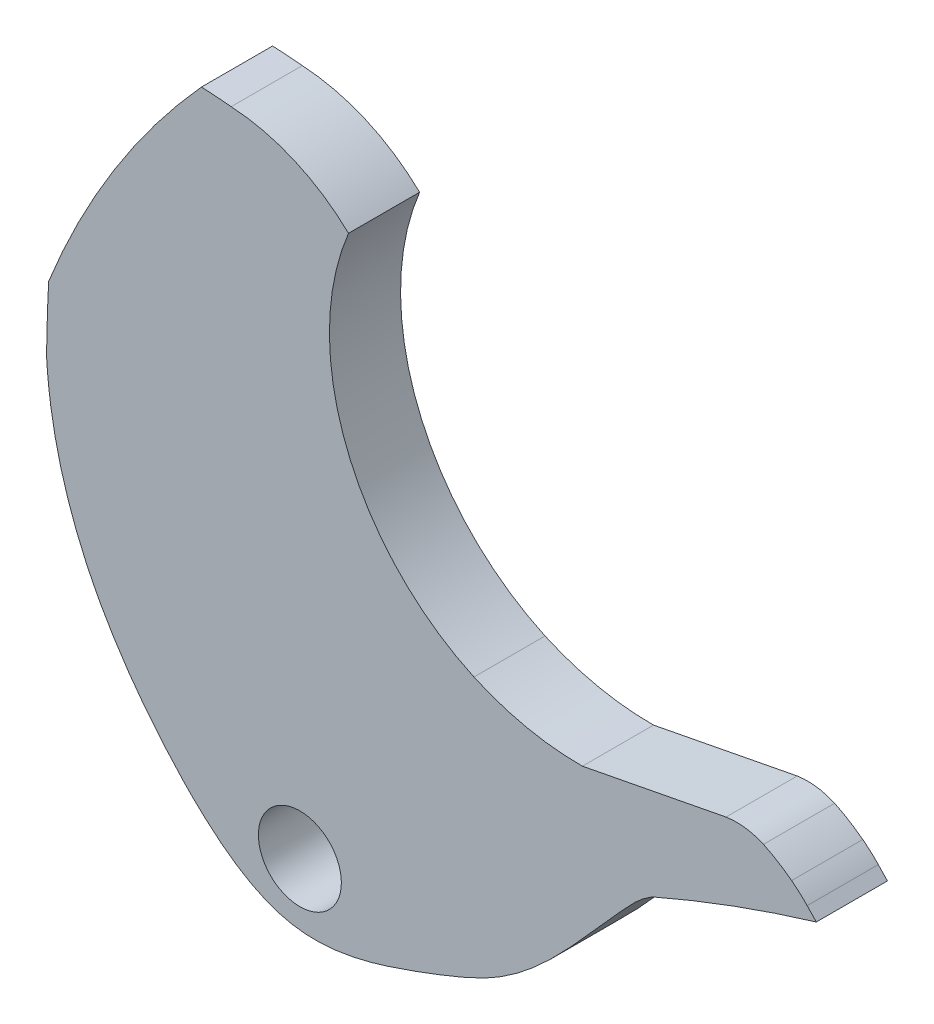
ISO-10303-21;
HEADER;
FILE_DESCRIPTION(('STEP AP214'),'2;1');
FILE_NAME('part.step','',(''),(''),'','','');
FILE_SCHEMA(('AUTOMOTIVE_DESIGN { 1 0 10303 214 1 1 1 1 }'));
ENDSEC;
DATA;
#1=APPLICATION_CONTEXT('core data for automotive mechanical design processes');
#2=APPLICATION_PROTOCOL_DEFINITION('international standard','automotive_design',2000,#1);
#3=PRODUCT_CONTEXT('',#1,'mechanical');
#4=PRODUCT('Part','Part','',(#3));
#5=PRODUCT_RELATED_PRODUCT_CATEGORY('part','',(#4));
#6=PRODUCT_DEFINITION_FORMATION('','',#4);
#7=PRODUCT_DEFINITION_CONTEXT('part definition',#1,'design');
#8=PRODUCT_DEFINITION('design','',#6,#7);
#9=PRODUCT_DEFINITION_SHAPE('','',#8);
#10=(LENGTH_UNIT() NAMED_UNIT(*) SI_UNIT(.MILLI.,.METRE.));
#11=(NAMED_UNIT(*) PLANE_ANGLE_UNIT() SI_UNIT($,.RADIAN.));
#12=(NAMED_UNIT(*) SI_UNIT($,.STERADIAN.) SOLID_ANGLE_UNIT());
#13=UNCERTAINTY_MEASURE_WITH_UNIT(LENGTH_MEASURE(1.E-05),#10,'distance_accuracy_value','');
#14=(GEOMETRIC_REPRESENTATION_CONTEXT(3) GLOBAL_UNCERTAINTY_ASSIGNED_CONTEXT((#13)) GLOBAL_UNIT_ASSIGNED_CONTEXT((#10,
#11,#12)) REPRESENTATION_CONTEXT('',''));
#15=CARTESIAN_POINT('',(0.,0.,0.));
#16=DIRECTION('',(0.,0.,1.));
#17=DIRECTION('',(1.,0.,0.));
#18=AXIS2_PLACEMENT_3D('',#15,#16,#17);
#19=CARTESIAN_POINT('',(8.25117117101575,-8.73657227185161,3.));
#20=DIRECTION('',(0.,0.,-1.));
#21=DIRECTION('',(-1.,0.,0.));
#22=AXIS2_PLACEMENT_3D('',#19,#20,#21);
#23=PLANE('',#22);
#24=CARTESIAN_POINT('',(9.62028650351375,-8.12784722487816,3.));
#25=CARTESIAN_POINT('',(9.17980211864895,-8.35044285989711,3.));
#26=CARTESIAN_POINT('',(8.72236085574302,-8.54750622541841,3.));
#27=CARTESIAN_POINT('',(8.01557632865212,-8.83110529506821,3.));
#28=CARTESIAN_POINT('',(7.77675812644258,-8.92404130425969,3.));
#29=CARTESIAN_POINT('',(7.29779458170795,-9.10631165689272,3.));
#30=CARTESIAN_POINT('',(7.05652031328897,-9.19587523587977,3.));
#31=CARTESIAN_POINT('',(6.81145608223271,-9.28468398787428,3.));
#32=B_SPLINE_CURVE_WITH_KNOTS('',3,(#24,#25,#26,#27,#28,#29,#30,#31),.UNSPECIFIED.,.F.,.F.,(4,2,
2,4),(0.,0.499999999999999,0.75,1.),.UNSPECIFIED.);
#33=CARTESIAN_POINT('',(6.81145608223271,-9.28468398787428,3.));
#34=VERTEX_POINT('',#33);
#35=CARTESIAN_POINT('',(9.62028650351375,-8.12784722487816,3.));
#36=VERTEX_POINT('',#35);
#37=EDGE_CURVE('E471',#34,#36,#32,.F.);
#38=ORIENTED_EDGE('',*,*,#37,.T.);
#39=CARTESIAN_POINT('',(16.8281752455163,-1.56135640571104,3.));
#40=CARTESIAN_POINT('',(16.6529192677787,-1.66446730117213,3.));
#41=CARTESIAN_POINT('',(16.4793040516283,-1.78580578128182,3.));
#42=CARTESIAN_POINT('',(16.169367003085,-2.04745330031033,3.));
#43=CARTESIAN_POINT('',(16.0298014146576,-2.18606812669837,3.));
#44=CARTESIAN_POINT('',(15.7437801668966,-2.48344053739451,3.));
#45=CARTESIAN_POINT('',(15.6021223854301,-2.63772679363682,3.));
#46=CARTESIAN_POINT('',(15.3236341426486,-2.94225173327598,3.));
#47=CARTESIAN_POINT('',(15.1849005778334,-3.09577571043314,3.));
#48=CARTESIAN_POINT('',(14.492337709762,-3.86973509951323,3.));
#49=CARTESIAN_POINT('',(13.946319139545,-4.50148997946698,3.));
#50=CARTESIAN_POINT('',(12.82093123337,-5.71203588118625,3.));
#51=CARTESIAN_POINT('',(12.2426101895869,-6.29113321402237,3.));
#52=CARTESIAN_POINT('',(11.3126737743175,-7.06418323190302,3.));
#53=CARTESIAN_POINT('',(10.9901237091513,-7.30737387180373,3.));
#54=CARTESIAN_POINT('',(10.4909670183963,-7.63855840106054,3.));
#55=CARTESIAN_POINT('',(10.3228661674392,-7.74264862921469,3.));
#56=CARTESIAN_POINT('',(9.97733967148719,-7.94180455004197,3.));
#57=CARTESIAN_POINT('',(9.80038257206845,-8.03683696407936,3.));
#58=CARTESIAN_POINT('',(9.62028650351375,-8.12784722487816,3.));
#59=B_SPLINE_CURVE_WITH_KNOTS('',3,(#39,#40,#41,#42,#43,#44,#45,#46,#47,#48,#49,#50,#51,#52,#53,
#54,#55,#56,#57,#58),.UNSPECIFIED.,.F.,.F.,(4,2,2,2,2,2,2,2,2,4),(0.,0.0624999999999999,0.125,
0.1875,0.25,0.5,0.75,0.874999999999999,0.9375,1.),.UNSPECIFIED.);
#60=CARTESIAN_POINT('',(16.8281752455163,-1.56135640571104,3.));
#61=VERTEX_POINT('',#60);
#62=EDGE_CURVE('E138',#36,#61,#59,.F.);
#63=ORIENTED_EDGE('',*,*,#62,.T.);
#64=CARTESIAN_POINT('',(41.4114635115163,-57.8448043143015,3.));
#65=DIRECTION('',(0.,0.,-1.));
#66=DIRECTION('',(1.,0.,0.));
#67=AXIS2_PLACEMENT_3D('',#64,#65,#66);
#68=CIRCLE('',#67,61.4179499043095);
#69=CARTESIAN_POINT('',(23.736412446226,0.974895959396316,3.));
#70=VERTEX_POINT('',#69);
#71=EDGE_CURVE('E392',#61,#70,#68,.T.);
#72=ORIENTED_EDGE('',*,*,#71,.T.);
#73=DIRECTION('',(-0.688314294819464,0.725412594009219,0.));
#74=VECTOR('',#73,1.);
#75=CARTESIAN_POINT('',(23.3513313053024,1.3807319436899,3.));
#76=LINE('',#75,#74);
#77=CARTESIAN_POINT('',(23.3513313053024,1.3807319436899,3.));
#78=VERTEX_POINT('',#77);
#79=EDGE_CURVE('E386',#70,#78,#76,.T.);
#80=ORIENTED_EDGE('',*,*,#79,.T.);
#81=CARTESIAN_POINT('',(19.3615620382517,-2.40499667781716,3.));
#82=DIRECTION('',(0.,0.,1.));
#83=DIRECTION('',(1.,0.,0.));
#84=AXIS2_PLACEMENT_3D('',#81,#82,#83);
#85=CIRCLE('',#84,5.49999999999999);
#86=CARTESIAN_POINT('',(22.6965246464227,1.96856301676817,3.));
#87=VERTEX_POINT('',#86);
#88=EDGE_CURVE('E391',#78,#87,#85,.T.);
#89=ORIENTED_EDGE('',*,*,#88,.T.);
#90=CARTESIAN_POINT('',(18.4479944033127,-3.603073854652,3.));
#91=DIRECTION('',(0.,0.,1.));
#92=DIRECTION('',(1.,0.,0.));
#93=AXIS2_PLACEMENT_3D('',#90,#91,#92);
#94=CIRCLE('',#93,7.00665017348438);
#95=CARTESIAN_POINT('',(21.5092543607841,2.69945215690648,3.));
#96=VERTEX_POINT('',#95);
#97=EDGE_CURVE('E394',#87,#96,#94,.T.);
#98=ORIENTED_EDGE('',*,*,#97,.T.);
#99=CARTESIAN_POINT('',(20.3707949009142,0.134545093826682,3.));
#100=DIRECTION('',(0.,0.,1.));
#101=DIRECTION('',(1.,0.,0.));
#102=AXIS2_PLACEMENT_3D('',#99,#100,#101);
#103=CIRCLE('',#102,2.80621420850295);
#104=CARTESIAN_POINT('',(19.9304110032006,2.90598879822308,3.));
#105=VERTEX_POINT('',#104);
#106=EDGE_CURVE('E396',#96,#105,#103,.T.);
#107=ORIENTED_EDGE('',*,*,#106,.T.);
#108=DIRECTION('',(-0.981845475111508,-0.189682532150585,0.));
#109=VECTOR('',#108,1.);
#110=CARTESIAN_POINT('',(19.9304110032006,2.90598879822308,3.));
#111=LINE('',#110,#109);
#112=CARTESIAN_POINT('',(13.8714523803976,1.73545978637591,3.));
#113=VERTEX_POINT('',#112);
#114=EDGE_CURVE('E398',#105,#113,#111,.T.);
#115=ORIENTED_EDGE('',*,*,#114,.T.);
#116=CARTESIAN_POINT('',(13.8009070771151,12.7020945939278,3.));
#117=DIRECTION('',(0.,0.,-1.));
#118=DIRECTION('',(1.,0.,0.));
#119=AXIS2_PLACEMENT_3D('',#116,#117,#118);
#120=CIRCLE('',#119,10.9668617043357);
#121=CARTESIAN_POINT('',(9.29603098715299,2.70318730082263,3.));
#122=VERTEX_POINT('',#121);
#123=EDGE_CURVE('E400',#113,#122,#120,.T.);
#124=ORIENTED_EDGE('',*,*,#123,.T.);
#125=CARTESIAN_POINT('',(13.7019216888151,12.2340910945353,3.));
#126=DIRECTION('',(0.,0.,-1.));
#127=DIRECTION('',(1.,0.,0.));
#128=AXIS2_PLACEMENT_3D('',#125,#126,#127);
#129=CIRCLE('',#128,10.4999999999999);
#130=CARTESIAN_POINT('',(4.00684121775,16.2658915186102,3.));
#131=VERTEX_POINT('',#130);
#132=EDGE_CURVE('E402',#122,#131,#129,.T.);
#133=ORIENTED_EDGE('',*,*,#132,.T.);
#134=CARTESIAN_POINT('',(-1.3940604911973,10.6052564925856,3.));
#135=DIRECTION('',(0.,0.,1.));
#136=DIRECTION('',(1.,0.,0.));
#137=AXIS2_PLACEMENT_3D('',#134,#135,#136);
#138=CIRCLE('',#137,7.82384356742683);
#139=CARTESIAN_POINT('',(-0.941946898938551,18.4160260748522,3.));
#140=VERTEX_POINT('',#139);
#141=EDGE_CURVE('E404',#131,#140,#138,.T.);
#142=ORIENTED_EDGE('',*,*,#141,.T.);
#143=CARTESIAN_POINT('',(-2.99299060987345,-1.69203897930691,3.));
#144=DIRECTION('',(0.,0.,1.));
#145=DIRECTION('',(1.,0.,0.));
#146=AXIS2_PLACEMENT_3D('',#143,#144,#145);
#147=CIRCLE('',#146,20.2123986831465);
#148=CARTESIAN_POINT('',(-2.1971601713027,18.5046863602006,3.));
#149=VERTEX_POINT('',#148);
#150=EDGE_CURVE('E406',#140,#149,#147,.T.);
#151=ORIENTED_EDGE('',*,*,#150,.T.);
#152=CARTESIAN_POINT('',(23.1641359216795,-4.50275843434775,3.));
#153=DIRECTION('',(0.,0.,1.));
#154=DIRECTION('',(1.,0.,0.));
#155=AXIS2_PLACEMENT_3D('',#152,#153,#154);
#156=CIRCLE('',#155,34.2423400995041);
#157=CARTESIAN_POINT('',(-8.63903891674994,8.18959854481075,3.));
#158=VERTEX_POINT('',#157);
#159=EDGE_CURVE('E408',#149,#158,#156,.T.);
#160=ORIENTED_EDGE('',*,*,#159,.T.);
#161=CARTESIAN_POINT('',(60.6415600077409,4.59193536232363,3.));
#162=DIRECTION('',(0.,0.,1.));
#163=DIRECTION('',(-1.,0.,0.));
#164=AXIS2_PLACEMENT_3D('',#161,#162,#163);
#165=CIRCLE('',#164,69.3739473268662);
#166=CARTESIAN_POINT('',(-8.72752538677928,5.41325091591366,3.));
#167=VERTEX_POINT('',#166);
#168=EDGE_CURVE('E410',#158,#167,#165,.T.);
#169=ORIENTED_EDGE('',*,*,#168,.T.);
#170=CARTESIAN_POINT('',(10.201841043741,6.46747029915103,3.));
#171=DIRECTION('',(0.,0.,1.));
#172=DIRECTION('',(1.,0.,0.));
#173=AXIS2_PLACEMENT_3D('',#170,#171,#172);
#174=CIRCLE('',#173,18.9586996381319);
#175=CARTESIAN_POINT('',(-8.6833723894637,4.79983558159267,3.));
#176=VERTEX_POINT('',#175);
#177=EDGE_CURVE('E412',#167,#176,#174,.T.);
#178=ORIENTED_EDGE('',*,*,#177,.T.);
#179=CARTESIAN_POINT('',(-7.06400769560621,-1.28129997996168,3.));
#180=CARTESIAN_POINT('',(-7.50205297870856,-0.33160611677286,3.));
#181=CARTESIAN_POINT('',(-7.85937118671749,0.648508115106866,3.));
#182=CARTESIAN_POINT('',(-8.40229429907405,2.67447956130265,3.));
#183=CARTESIAN_POINT('',(-8.58807459137486,3.72116380460375,3.));
#184=CARTESIAN_POINT('',(-8.68337238946358,4.79983558159268,3.));
#185=B_SPLINE_CURVE_WITH_KNOTS('',3,(#179,#180,#181,#182,#183,#184),.UNSPECIFIED.,.F.,.F.,(4,2,
4),(0.,0.5,1.),.UNSPECIFIED.);
#186=CARTESIAN_POINT('',(-7.06400769560621,-1.28129997996168,3.));
#187=VERTEX_POINT('',#186);
#188=EDGE_CURVE('E771',#176,#187,#185,.F.);
#189=ORIENTED_EDGE('',*,*,#188,.T.);
#190=CARTESIAN_POINT('',(-2.97381791978536,-7.20382634162153,3.));
#191=CARTESIAN_POINT('',(-3.40882724033922,-6.74810305034977,3.));
#192=CARTESIAN_POINT('',(-3.81797623210393,-6.28180118328278,3.));
#193=CARTESIAN_POINT('',(-4.59187789010131,-5.32914333541592,3.));
#194=CARTESIAN_POINT('',(-4.95762994762071,-4.84262589012287,3.));
#195=CARTESIAN_POINT('',(-5.98506042983869,-3.36121667474243,3.));
#196=CARTESIAN_POINT('',(-6.57517087116233,-2.34111126017262,3.));
#197=CARTESIAN_POINT('',(-7.06400769560621,-1.28129997996168,3.));
#198=B_SPLINE_CURVE_WITH_KNOTS('',3,(#190,#191,#192,#193,#194,#195,#196,#197),.UNSPECIFIED.,.F.,
.F.,(4,2,2,4),(0.,0.25,0.5,1.),.UNSPECIFIED.);
#199=CARTESIAN_POINT('',(-2.97381791978536,-7.20382634162153,3.));
#200=VERTEX_POINT('',#199);
#201=EDGE_CURVE('E196',#187,#200,#198,.F.);
#202=ORIENTED_EDGE('',*,*,#201,.T.);
#203=CARTESIAN_POINT('',(1.60276659843023,-10.1599057250444,3.));
#204=CARTESIAN_POINT('',(1.39100926344457,-10.1210471290185,3.));
#205=CARTESIAN_POINT('',(1.1817732939461,-10.0677256483114,3.));
#206=CARTESIAN_POINT('',(0.764136140560738,-9.93388728338505,3.));
#207=CARTESIAN_POINT('',(0.556953087107,-9.85365075535664,3.));
#208=CARTESIAN_POINT('',(-0.0535130630887347,-9.57950774710137,3.));
#209=CARTESIAN_POINT('',(-0.445412996672957,-9.35234524044181,3.));
#210=CARTESIAN_POINT('',(-1.59027920639914,-8.56570688958112,3.));
#211=CARTESIAN_POINT('',(-2.30644650900845,-7.90297617920669,3.));
#212=CARTESIAN_POINT('',(-2.97381791978536,-7.20382634162153,3.));
#213=B_SPLINE_CURVE_WITH_KNOTS('',3,(#203,#204,#205,#206,#207,#208,#209,#210,#211,#212),
.UNSPECIFIED.,.F.,.F.,(4,2,2,2,4),(0.,0.125,0.25,0.5,1.),.UNSPECIFIED.);
#214=CARTESIAN_POINT('',(1.60276659843023,-10.1599057250444,3.));
#215=VERTEX_POINT('',#214);
#216=EDGE_CURVE('E188',#200,#215,#213,.F.);
#217=ORIENTED_EDGE('',*,*,#216,.T.);
#218=CARTESIAN_POINT('',(4.22745433705887,-10.0642248372999,3.));
#219=CARTESIAN_POINT('',(3.77994434838323,-10.157384511052,3.));
#220=CARTESIAN_POINT('',(3.33727275371652,-10.2203682924585,3.));
#221=CARTESIAN_POINT('',(2.45901895610473,-10.2600164317434,3.));
#222=CARTESIAN_POINT('',(2.01987178261533,-10.2364467424012,3.));
#223=CARTESIAN_POINT('',(1.60276659843023,-10.1599057250444,3.));
#224=B_SPLINE_CURVE_WITH_KNOTS('',3,(#218,#219,#220,#221,#222,#223),.UNSPECIFIED.,.F.,.F.,(4,2,
4),(0.,0.5,1.),.UNSPECIFIED.);
#225=CARTESIAN_POINT('',(4.22745433705887,-10.0642248372999,3.));
#226=VERTEX_POINT('',#225);
#227=EDGE_CURVE('E193',#215,#226,#224,.F.);
#228=ORIENTED_EDGE('',*,*,#227,.T.);
#229=CARTESIAN_POINT('',(6.81145608223271,-9.28468398787428,3.));
#230=CARTESIAN_POINT('',(5.9628025048854,-9.59222729909122,3.));
#231=CARTESIAN_POINT('',(5.08977018464955,-9.88471361952676,3.));
#232=CARTESIAN_POINT('',(4.22745433705887,-10.0642248372999,3.));
#233=B_SPLINE_CURVE_WITH_KNOTS('',3,(#229,#230,#231,#232),.UNSPECIFIED.,.F.,.F.,(4,4),(0.,1.),.UNSPECIFIED.);
#234=EDGE_CURVE('E56',#226,#34,#233,.F.);
#235=ORIENTED_EDGE('',*,*,#234,.T.);
#236=EDGE_LOOP('',(#38,#63,#72,#80,#89,#98,#107,#115,#124,#133,#142,#151,#160,#169,#178,#189,
#202,#217,#228,#235));
#237=FACE_BOUND('',#236,.T.);
#238=CARTESIAN_POINT('',(1.95557972946252,-7.60507725039979,3.));
#239=DIRECTION('',(0.,0.,1.));
#240=DIRECTION('',(1.,0.,0.));
#241=AXIS2_PLACEMENT_3D('',#238,#239,#240);
#242=CIRCLE('',#241,1.75);
#243=CARTESIAN_POINT('',(3.70557972946252,-7.60507725039979,3.));
#244=VERTEX_POINT('',#243);
#245=EDGE_CURVE('E538',#244,#244,#242,.T.);
#246=ORIENTED_EDGE('',*,*,#245,.F.);
#247=EDGE_LOOP('',(#246));
#248=FACE_BOUND('',#247,.T.);
#249=ADVANCED_FACE('F33',(#237,#248),#23,.F.);
#250=CARTESIAN_POINT('',(8.25117117101575,-8.73657227185161,0.));
#251=DIRECTION('',(0.,0.,-1.));
#252=DIRECTION('',(-1.,0.,0.));
#253=AXIS2_PLACEMENT_3D('',#250,#251,#252);
#254=PLANE('',#253);
#255=CARTESIAN_POINT('',(6.81145608223271,-9.28468398787428,0.));
#256=CARTESIAN_POINT('',(7.05652031328897,-9.19587523587977,0.));
#257=CARTESIAN_POINT('',(7.29779458170795,-9.10631165689272,0.));
#258=CARTESIAN_POINT('',(7.77675812644258,-8.92404130425969,0.));
#259=CARTESIAN_POINT('',(8.01557632865212,-8.83110529506821,0.));
#260=CARTESIAN_POINT('',(8.72236085574302,-8.54750622541841,0.));
#261=CARTESIAN_POINT('',(9.17980211864895,-8.35044285989711,0.));
#262=CARTESIAN_POINT('',(9.62028650351375,-8.12784722487816,0.));
#263=B_SPLINE_CURVE_WITH_KNOTS('',3,(#255,#256,#257,#258,#259,#260,#261,#262),.UNSPECIFIED.,.F.,
.F.,(4,2,2,4),(0.,0.25,0.500000000000001,1.),.UNSPECIFIED.);
#264=CARTESIAN_POINT('',(6.81145608223271,-9.28468398787428,0.));
#265=VERTEX_POINT('',#264);
#266=CARTESIAN_POINT('',(9.62028650351375,-8.12784722487816,0.));
#267=VERTEX_POINT('',#266);
#268=EDGE_CURVE('E528',#265,#267,#263,.T.);
#269=ORIENTED_EDGE('',*,*,#268,.F.);
#270=CARTESIAN_POINT('',(4.22745433705887,-10.0642248372999,0.));
#271=CARTESIAN_POINT('',(5.08977018464955,-9.88471361952676,0.));
#272=CARTESIAN_POINT('',(5.9628025048854,-9.59222729909122,0.));
#273=CARTESIAN_POINT('',(6.81145608223271,-9.28468398787428,0.));
#274=B_SPLINE_CURVE_WITH_KNOTS('',3,(#270,#271,#272,#273),.UNSPECIFIED.,.F.,.F.,(4,4),(0.,1.),.UNSPECIFIED.);
#275=CARTESIAN_POINT('',(4.22745433705887,-10.0642248372999,0.));
#276=VERTEX_POINT('',#275);
#277=EDGE_CURVE('E129',#276,#265,#274,.T.);
#278=ORIENTED_EDGE('',*,*,#277,.F.);
#279=CARTESIAN_POINT('',(1.60276659843023,-10.1599057250444,0.));
#280=CARTESIAN_POINT('',(2.01987178261533,-10.2364467424012,0.));
#281=CARTESIAN_POINT('',(2.45901895610473,-10.2600164317434,0.));
#282=CARTESIAN_POINT('',(3.33727275371652,-10.2203682924585,0.));
#283=CARTESIAN_POINT('',(3.77994434838323,-10.157384511052,0.));
#284=CARTESIAN_POINT('',(4.22745433705887,-10.0642248372999,0.));
#285=B_SPLINE_CURVE_WITH_KNOTS('',3,(#279,#280,#281,#282,#283,#284),.UNSPECIFIED.,.F.,.F.,(4,2,
4),(0.,0.5,1.),.UNSPECIFIED.);
#286=CARTESIAN_POINT('',(1.60276659843023,-10.1599057250444,0.));
#287=VERTEX_POINT('',#286);
#288=EDGE_CURVE('E122',#287,#276,#285,.T.);
#289=ORIENTED_EDGE('',*,*,#288,.F.);
#290=CARTESIAN_POINT('',(-2.97381791978536,-7.20382634162153,0.));
#291=CARTESIAN_POINT('',(-2.30644650900845,-7.90297617920669,0.));
#292=CARTESIAN_POINT('',(-1.59027920639914,-8.56570688958112,0.));
#293=CARTESIAN_POINT('',(-0.445412996672957,-9.35234524044181,0.));
#294=CARTESIAN_POINT('',(-0.0535130630887347,-9.57950774710137,0.));
#295=CARTESIAN_POINT('',(0.556953087107,-9.85365075535664,0.));
#296=CARTESIAN_POINT('',(0.764136140560738,-9.93388728338505,0.));
#297=CARTESIAN_POINT('',(1.1817732939461,-10.0677256483114,0.));
#298=CARTESIAN_POINT('',(1.39100926344457,-10.1210471290185,0.));
#299=CARTESIAN_POINT('',(1.60276659843023,-10.1599057250444,0.));
#300=B_SPLINE_CURVE_WITH_KNOTS('',3,(#290,#291,#292,#293,#294,#295,#296,#297,#298,#299),
.UNSPECIFIED.,.F.,.F.,(4,2,2,2,4),(0.,0.5,0.75,0.875,1.),.UNSPECIFIED.);
#301=CARTESIAN_POINT('',(-2.97381791978536,-7.20382634162153,0.));
#302=VERTEX_POINT('',#301);
#303=EDGE_CURVE('E207',#302,#287,#300,.T.);
#304=ORIENTED_EDGE('',*,*,#303,.F.);
#305=CARTESIAN_POINT('',(-7.06400769560621,-1.28129997996168,0.));
#306=CARTESIAN_POINT('',(-6.57517087116233,-2.34111126017262,0.));
#307=CARTESIAN_POINT('',(-5.98506042983869,-3.36121667474243,0.));
#308=CARTESIAN_POINT('',(-4.95762994762071,-4.84262589012287,0.));
#309=CARTESIAN_POINT('',(-4.59187789010131,-5.32914333541592,0.));
#310=CARTESIAN_POINT('',(-3.81797623210393,-6.28180118328278,0.));
#311=CARTESIAN_POINT('',(-3.40882724033922,-6.74810305034977,0.));
#312=CARTESIAN_POINT('',(-2.97381791978536,-7.20382634162153,0.));
#313=B_SPLINE_CURVE_WITH_KNOTS('',3,(#305,#306,#307,#308,#309,#310,#311,#312),.UNSPECIFIED.,.F.,
.F.,(4,2,2,4),(0.,0.5,0.75,1.),.UNSPECIFIED.);
#314=CARTESIAN_POINT('',(-7.06400769560621,-1.28129997996168,0.));
#315=VERTEX_POINT('',#314);
#316=EDGE_CURVE('E466',#315,#302,#313,.T.);
#317=ORIENTED_EDGE('',*,*,#316,.F.);
#318=CARTESIAN_POINT('',(-8.68337238946358,4.79983558159268,0.));
#319=CARTESIAN_POINT('',(-8.58807459137486,3.72116380460375,0.));
#320=CARTESIAN_POINT('',(-8.40229429907405,2.67447956130265,0.));
#321=CARTESIAN_POINT('',(-7.85937118671749,0.648508115106866,0.));
#322=CARTESIAN_POINT('',(-7.50205297870856,-0.33160611677286,0.));
#323=CARTESIAN_POINT('',(-7.06400769560621,-1.28129997996168,0.));
#324=B_SPLINE_CURVE_WITH_KNOTS('',3,(#318,#319,#320,#321,#322,#323),.UNSPECIFIED.,.F.,.F.,(4,2,
4),(0.,0.5,1.),.UNSPECIFIED.);
#325=CARTESIAN_POINT('',(-8.6833723894637,4.79983558159267,0.));
#326=VERTEX_POINT('',#325);
#327=EDGE_CURVE('E453',#326,#315,#324,.T.);
#328=ORIENTED_EDGE('',*,*,#327,.F.);
#329=CARTESIAN_POINT('',(10.201841043741,6.46747029915103,0.));
#330=DIRECTION('',(0.,0.,1.));
#331=DIRECTION('',(1.,0.,0.));
#332=AXIS2_PLACEMENT_3D('',#329,#330,#331);
#333=CIRCLE('',#332,18.9586996381319);
#334=CARTESIAN_POINT('',(-8.72752538677928,5.41325091591366,0.));
#335=VERTEX_POINT('',#334);
#336=EDGE_CURVE('E280',#335,#326,#333,.T.);
#337=ORIENTED_EDGE('',*,*,#336,.F.);
#338=CARTESIAN_POINT('',(60.6415600077409,4.59193536232363,0.));
#339=DIRECTION('',(0.,0.,1.));
#340=DIRECTION('',(-1.,0.,0.));
#341=AXIS2_PLACEMENT_3D('',#338,#339,#340);
#342=CIRCLE('',#341,69.3739473268662);
#343=CARTESIAN_POINT('',(-8.63903891674994,8.18959854481075,0.));
#344=VERTEX_POINT('',#343);
#345=EDGE_CURVE('E278',#344,#335,#342,.T.);
#346=ORIENTED_EDGE('',*,*,#345,.F.);
#347=CARTESIAN_POINT('',(23.1641359216795,-4.50275843434775,0.));
#348=DIRECTION('',(0.,0.,1.));
#349=DIRECTION('',(1.,0.,0.));
#350=AXIS2_PLACEMENT_3D('',#347,#348,#349);
#351=CIRCLE('',#350,34.2423400995041);
#352=CARTESIAN_POINT('',(-2.1971601713027,18.5046863602006,0.));
#353=VERTEX_POINT('',#352);
#354=EDGE_CURVE('E276',#353,#344,#351,.T.);
#355=ORIENTED_EDGE('',*,*,#354,.F.);
#356=CARTESIAN_POINT('',(-2.99299060987345,-1.69203897930691,0.));
#357=DIRECTION('',(0.,0.,1.));
#358=DIRECTION('',(1.,0.,0.));
#359=AXIS2_PLACEMENT_3D('',#356,#357,#358);
#360=CIRCLE('',#359,20.2123986831465);
#361=CARTESIAN_POINT('',(-0.941946898938551,18.4160260748522,0.));
#362=VERTEX_POINT('',#361);
#363=EDGE_CURVE('E274',#362,#353,#360,.T.);
#364=ORIENTED_EDGE('',*,*,#363,.F.);
#365=CARTESIAN_POINT('',(-1.3940604911973,10.6052564925856,0.));
#366=DIRECTION('',(0.,0.,1.));
#367=DIRECTION('',(1.,0.,0.));
#368=AXIS2_PLACEMENT_3D('',#365,#366,#367);
#369=CIRCLE('',#368,7.82384356742683);
#370=CARTESIAN_POINT('',(4.00684121775,16.2658915186102,0.));
#371=VERTEX_POINT('',#370);
#372=EDGE_CURVE('E272',#371,#362,#369,.T.);
#373=ORIENTED_EDGE('',*,*,#372,.F.);
#374=CARTESIAN_POINT('',(13.7019216888151,12.2340910945353,0.));
#375=DIRECTION('',(0.,0.,-1.));
#376=DIRECTION('',(1.,0.,0.));
#377=AXIS2_PLACEMENT_3D('',#374,#375,#376);
#378=CIRCLE('',#377,10.4999999999999);
#379=CARTESIAN_POINT('',(9.29603098715299,2.70318730082263,0.));
#380=VERTEX_POINT('',#379);
#381=EDGE_CURVE('E270',#380,#371,#378,.T.);
#382=ORIENTED_EDGE('',*,*,#381,.F.);
#383=CARTESIAN_POINT('',(13.8009070771151,12.7020945939278,0.));
#384=DIRECTION('',(0.,0.,-1.));
#385=DIRECTION('',(1.,0.,0.));
#386=AXIS2_PLACEMENT_3D('',#383,#384,#385);
#387=CIRCLE('',#386,10.9668617043357);
#388=CARTESIAN_POINT('',(13.8714523803976,1.73545978637591,0.));
#389=VERTEX_POINT('',#388);
#390=EDGE_CURVE('E268',#389,#380,#387,.T.);
#391=ORIENTED_EDGE('',*,*,#390,.F.);
#392=DIRECTION('',(-0.981845475111508,-0.189682532150585,0.));
#393=VECTOR('',#392,1.);
#394=CARTESIAN_POINT('',(19.9304110032006,2.90598879822308,0.));
#395=LINE('',#394,#393);
#396=CARTESIAN_POINT('',(19.9304110032006,2.90598879822308,0.));
#397=VERTEX_POINT('',#396);
#398=EDGE_CURVE('E266',#397,#389,#395,.T.);
#399=ORIENTED_EDGE('',*,*,#398,.F.);
#400=CARTESIAN_POINT('',(20.3707949009142,0.134545093826682,0.));
#401=DIRECTION('',(0.,0.,1.));
#402=DIRECTION('',(1.,0.,0.));
#403=AXIS2_PLACEMENT_3D('',#400,#401,#402);
#404=CIRCLE('',#403,2.80621420850295);
#405=CARTESIAN_POINT('',(21.5092543607841,2.69945215690648,0.));
#406=VERTEX_POINT('',#405);
#407=EDGE_CURVE('E264',#406,#397,#404,.T.);
#408=ORIENTED_EDGE('',*,*,#407,.F.);
#409=CARTESIAN_POINT('',(18.4479944033127,-3.603073854652,0.));
#410=DIRECTION('',(0.,0.,1.));
#411=DIRECTION('',(1.,0.,0.));
#412=AXIS2_PLACEMENT_3D('',#409,#410,#411);
#413=CIRCLE('',#412,7.00665017348438);
#414=CARTESIAN_POINT('',(22.6965246464227,1.96856301676817,0.));
#415=VERTEX_POINT('',#414);
#416=EDGE_CURVE('E262',#415,#406,#413,.T.);
#417=ORIENTED_EDGE('',*,*,#416,.F.);
#418=CARTESIAN_POINT('',(19.3615620382517,-2.40499667781716,0.));
#419=DIRECTION('',(0.,0.,1.));
#420=DIRECTION('',(1.,0.,0.));
#421=AXIS2_PLACEMENT_3D('',#418,#419,#420);
#422=CIRCLE('',#421,5.49999999999999);
#423=CARTESIAN_POINT('',(23.3513313053024,1.3807319436899,0.));
#424=VERTEX_POINT('',#423);
#425=EDGE_CURVE('E259',#424,#415,#422,.T.);
#426=ORIENTED_EDGE('',*,*,#425,.F.);
#427=DIRECTION('',(-0.688314294819464,0.725412594009219,0.));
#428=VECTOR('',#427,1.);
#429=CARTESIAN_POINT('',(23.3513313053024,1.3807319436899,0.));
#430=LINE('',#429,#428);
#431=CARTESIAN_POINT('',(23.736412446226,0.974895959396316,0.));
#432=VERTEX_POINT('',#431);
#433=EDGE_CURVE('E254',#432,#424,#430,.T.);
#434=ORIENTED_EDGE('',*,*,#433,.F.);
#435=CARTESIAN_POINT('',(41.4114635115163,-57.8448043143015,0.));
#436=DIRECTION('',(0.,0.,-1.));
#437=DIRECTION('',(1.,0.,0.));
#438=AXIS2_PLACEMENT_3D('',#435,#436,#437);
#439=CIRCLE('',#438,61.4179499043095);
#440=CARTESIAN_POINT('',(16.8281752455163,-1.56135640571104,0.));
#441=VERTEX_POINT('',#440);
#442=EDGE_CURVE('E260',#441,#432,#439,.T.);
#443=ORIENTED_EDGE('',*,*,#442,.F.);
#444=CARTESIAN_POINT('',(9.62028650351375,-8.12784722487816,0.));
#445=CARTESIAN_POINT('',(9.80038257206845,-8.03683696407936,0.));
#446=CARTESIAN_POINT('',(9.97733967148719,-7.94180455004197,0.));
#447=CARTESIAN_POINT('',(10.3228661674392,-7.74264862921469,0.));
#448=CARTESIAN_POINT('',(10.4909670183963,-7.63855840106054,0.));
#449=CARTESIAN_POINT('',(10.9901237091513,-7.30737387180373,0.));
#450=CARTESIAN_POINT('',(11.3126737743175,-7.06418323190302,0.));
#451=CARTESIAN_POINT('',(12.2426101895869,-6.29113321402237,0.));
#452=CARTESIAN_POINT('',(12.82093123337,-5.71203588118625,0.));
#453=CARTESIAN_POINT('',(13.946319139545,-4.50148997946698,0.));
#454=CARTESIAN_POINT('',(14.492337709762,-3.86973509951323,0.));
#455=CARTESIAN_POINT('',(15.1849005778334,-3.09577571043314,0.));
#456=CARTESIAN_POINT('',(15.3236341426486,-2.94225173327598,0.));
#457=CARTESIAN_POINT('',(15.6021223854301,-2.63772679363682,0.));
#458=CARTESIAN_POINT('',(15.7437801668966,-2.48344053739451,0.));
#459=CARTESIAN_POINT('',(16.0298014146576,-2.18606812669837,0.));
#460=CARTESIAN_POINT('',(16.169367003085,-2.04745330031033,0.));
#461=CARTESIAN_POINT('',(16.4793040516283,-1.78580578128182,0.));
#462=CARTESIAN_POINT('',(16.6529192677787,-1.66446730117213,0.));
#463=CARTESIAN_POINT('',(16.8281752455163,-1.56135640571104,0.));
#464=B_SPLINE_CURVE_WITH_KNOTS('',3,(#444,#445,#446,#447,#448,#449,#450,#451,#452,#453,#454,
#455,#456,#457,#458,#459,#460,#461,#462,#463),.UNSPECIFIED.,.F.,.F.,(4,2,2,2,2,2,2,2,2,4),(0.,
0.0625000000000003,0.125000000000001,0.25,0.5,0.75,0.8125,0.875,0.9375,1.),.UNSPECIFIED.);
#465=EDGE_CURVE('E485',#267,#441,#464,.T.);
#466=ORIENTED_EDGE('',*,*,#465,.F.);
#467=EDGE_LOOP('',(#269,#278,#289,#304,#317,#328,#337,#346,#355,#364,#373,#382,#391,#399,#408,
#417,#426,#434,#443,#466));
#468=FACE_BOUND('',#467,.T.);
#469=CARTESIAN_POINT('',(1.95557972946252,-7.60507725039979,0.));
#470=DIRECTION('',(0.,0.,1.));
#471=DIRECTION('',(1.,0.,0.));
#472=AXIS2_PLACEMENT_3D('',#469,#470,#471);
#473=CIRCLE('',#472,1.75);
#474=CARTESIAN_POINT('',(3.70557972946252,-7.60507725039979,0.));
#475=VERTEX_POINT('',#474);
#476=EDGE_CURVE('E540',#475,#475,#473,.T.);
#477=ORIENTED_EDGE('',*,*,#476,.T.);
#478=EDGE_LOOP('',(#477));
#479=FACE_BOUND('',#478,.T.);
#480=ADVANCED_FACE('F330',(#468,#479),#254,.T.);
#481=CARTESIAN_POINT('',(6.81145608223271,-9.28468398787428,3.));
#482=CARTESIAN_POINT('',(7.05652031328897,-9.19587523587977,3.));
#483=CARTESIAN_POINT('',(7.29779458170795,-9.10631165689272,3.));
#484=CARTESIAN_POINT('',(7.77675812644258,-8.92404130425969,3.));
#485=CARTESIAN_POINT('',(8.01557632865212,-8.83110529506821,3.));
#486=CARTESIAN_POINT('',(8.72236085574302,-8.54750622541841,3.));
#487=CARTESIAN_POINT('',(9.17980211864895,-8.35044285989711,3.));
#488=CARTESIAN_POINT('',(9.62028650351375,-8.12784722487816,3.));
#489=B_SPLINE_CURVE_WITH_KNOTS('',3,(#481,#482,#483,#484,#485,#486,#487,#488),.UNSPECIFIED.,.F.,
.F.,(4,2,2,4),(0.,0.25,0.500000000000001,1.),.UNSPECIFIED.);
#490=DIRECTION('',(0.,0.,-1.));
#491=VECTOR('',#490,1.);
#492=SURFACE_OF_LINEAR_EXTRUSION('',#489,#491);
#493=ORIENTED_EDGE('',*,*,#268,.T.);
#494=DIRECTION('',(0.,0.,-1.));
#495=VECTOR('',#494,1.);
#496=CARTESIAN_POINT('',(9.62028650351375,-8.12784722487816,3.));
#497=LINE('',#496,#495);
#498=EDGE_CURVE('E11',#36,#267,#497,.T.);
#499=ORIENTED_EDGE('',*,*,#498,.F.);
#500=ORIENTED_EDGE('',*,*,#37,.F.);
#501=DIRECTION('',(0.,0.,-1.));
#502=VECTOR('',#501,1.);
#503=CARTESIAN_POINT('',(6.81145608223271,-9.28468398787428,3.));
#504=LINE('',#503,#502);
#505=EDGE_CURVE('E870',#34,#265,#504,.T.);
#506=ORIENTED_EDGE('',*,*,#505,.T.);
#507=EDGE_LOOP('',(#493,#499,#500,#506));
#508=FACE_BOUND('',#507,.T.);
#509=ADVANCED_FACE('F35',(#508),#492,.F.);
#510=CARTESIAN_POINT('',(9.62028650351375,-8.12784722487816,3.));
#511=CARTESIAN_POINT('',(9.80038257206845,-8.03683696407936,3.));
#512=CARTESIAN_POINT('',(9.97733967148719,-7.94180455004197,3.));
#513=CARTESIAN_POINT('',(10.3228661674392,-7.74264862921469,3.));
#514=CARTESIAN_POINT('',(10.4909670183963,-7.63855840106054,3.));
#515=CARTESIAN_POINT('',(10.9901237091513,-7.30737387180373,3.));
#516=CARTESIAN_POINT('',(11.3126737743175,-7.06418323190302,3.));
#517=CARTESIAN_POINT('',(12.2426101895869,-6.29113321402237,3.));
#518=CARTESIAN_POINT('',(12.82093123337,-5.71203588118625,3.));
#519=CARTESIAN_POINT('',(13.946319139545,-4.50148997946698,3.));
#520=CARTESIAN_POINT('',(14.492337709762,-3.86973509951323,3.));
#521=CARTESIAN_POINT('',(15.1849005778334,-3.09577571043314,3.));
#522=CARTESIAN_POINT('',(15.3236341426486,-2.94225173327598,3.));
#523=CARTESIAN_POINT('',(15.6021223854301,-2.63772679363682,3.));
#524=CARTESIAN_POINT('',(15.7437801668966,-2.48344053739451,3.));
#525=CARTESIAN_POINT('',(16.0298014146576,-2.18606812669837,3.));
#526=CARTESIAN_POINT('',(16.169367003085,-2.04745330031033,3.));
#527=CARTESIAN_POINT('',(16.4793040516283,-1.78580578128182,3.));
#528=CARTESIAN_POINT('',(16.6529192677787,-1.66446730117213,3.));
#529=CARTESIAN_POINT('',(16.8281752455163,-1.56135640571104,3.));
#530=B_SPLINE_CURVE_WITH_KNOTS('',3,(#510,#511,#512,#513,#514,#515,#516,#517,#518,#519,#520,
#521,#522,#523,#524,#525,#526,#527,#528,#529),.UNSPECIFIED.,.F.,.F.,(4,2,2,2,2,2,2,2,2,4),(0.,
0.0625000000000003,0.125000000000001,0.25,0.5,0.75,0.8125,0.875,0.9375,1.),.UNSPECIFIED.);
#531=DIRECTION('',(0.,0.,-1.));
#532=VECTOR('',#531,1.);
#533=SURFACE_OF_LINEAR_EXTRUSION('',#530,#532);
#534=ORIENTED_EDGE('',*,*,#465,.T.);
#535=DIRECTION('',(0.,0.,-1.));
#536=VECTOR('',#535,1.);
#537=CARTESIAN_POINT('',(16.8281752455163,-1.56135640571104,3.));
#538=LINE('',#537,#536);
#539=EDGE_CURVE('E47',#61,#441,#538,.T.);
#540=ORIENTED_EDGE('',*,*,#539,.F.);
#541=ORIENTED_EDGE('',*,*,#62,.F.);
#542=ORIENTED_EDGE('',*,*,#498,.T.);
#543=EDGE_LOOP('',(#534,#540,#541,#542));
#544=FACE_BOUND('',#543,.T.);
#545=ADVANCED_FACE('F365',(#544),#533,.F.);
#546=CARTESIAN_POINT('',(41.4114635115163,-57.8448043143015,3.));
#547=DIRECTION('',(0.,0.,-1.));
#548=DIRECTION('',(-1.,0.,0.));
#549=AXIS2_PLACEMENT_3D('',#546,#547,#548);
#550=CYLINDRICAL_SURFACE('',#549,61.4179499043095);
#551=ORIENTED_EDGE('',*,*,#442,.T.);
#552=DIRECTION('',(0.,0.,-1.));
#553=VECTOR('',#552,1.);
#554=CARTESIAN_POINT('',(23.736412446226,0.974895959396316,3.));
#555=LINE('',#554,#553);
#556=EDGE_CURVE('E315',#70,#432,#555,.T.);
#557=ORIENTED_EDGE('',*,*,#556,.F.);
#558=ORIENTED_EDGE('',*,*,#71,.F.);
#559=ORIENTED_EDGE('',*,*,#539,.T.);
#560=EDGE_LOOP('',(#551,#557,#558,#559));
#561=FACE_BOUND('',#560,.T.);
#562=ADVANCED_FACE('F375',(#561),#550,.F.);
#563=CARTESIAN_POINT('',(23.3513313053024,1.3807319436899,3.));
#564=DIRECTION('',(-0.725412594009219,-0.688314294819464,0.));
#565=DIRECTION('',(0.688314294819464,-0.725412594009219,0.));
#566=AXIS2_PLACEMENT_3D('',#563,#564,#565);
#567=PLANE('',#566);
#568=ORIENTED_EDGE('',*,*,#433,.T.);
#569=DIRECTION('',(0.,0.,-1.));
#570=VECTOR('',#569,1.);
#571=CARTESIAN_POINT('',(23.3513313053024,1.3807319436899,3.));
#572=LINE('',#571,#570);
#573=EDGE_CURVE('E312',#78,#424,#572,.T.);
#574=ORIENTED_EDGE('',*,*,#573,.F.);
#575=ORIENTED_EDGE('',*,*,#79,.F.);
#576=ORIENTED_EDGE('',*,*,#556,.T.);
#577=EDGE_LOOP('',(#568,#574,#575,#576));
#578=FACE_BOUND('',#577,.T.);
#579=ADVANCED_FACE('F654',(#578),#567,.F.);
#580=CARTESIAN_POINT('',(19.3615620382517,-2.40499667781716,3.));
#581=DIRECTION('',(0.,0.,-1.));
#582=DIRECTION('',(-1.,0.,0.));
#583=AXIS2_PLACEMENT_3D('',#580,#581,#582);
#584=CYLINDRICAL_SURFACE('',#583,5.49999999999999);
#585=ORIENTED_EDGE('',*,*,#425,.T.);
#586=DIRECTION('',(0.,0.,-1.));
#587=VECTOR('',#586,1.);
#588=CARTESIAN_POINT('',(22.6965246464227,1.96856301676817,3.));
#589=LINE('',#588,#587);
#590=EDGE_CURVE('E309',#87,#415,#589,.T.);
#591=ORIENTED_EDGE('',*,*,#590,.F.);
#592=ORIENTED_EDGE('',*,*,#88,.F.);
#593=ORIENTED_EDGE('',*,*,#573,.T.);
#594=EDGE_LOOP('',(#585,#591,#592,#593));
#595=FACE_BOUND('',#594,.T.);
#596=ADVANCED_FACE('F646',(#595),#584,.T.);
#597=CARTESIAN_POINT('',(18.4479944033127,-3.603073854652,3.));
#598=DIRECTION('',(0.,0.,-1.));
#599=DIRECTION('',(-1.,0.,0.));
#600=AXIS2_PLACEMENT_3D('',#597,#598,#599);
#601=CYLINDRICAL_SURFACE('',#600,7.00665017348438);
#602=ORIENTED_EDGE('',*,*,#416,.T.);
#603=DIRECTION('',(0.,0.,-1.));
#604=VECTOR('',#603,1.);
#605=CARTESIAN_POINT('',(21.5092543607841,2.69945215690648,3.));
#606=LINE('',#605,#604);
#607=EDGE_CURVE('E306',#96,#406,#606,.T.);
#608=ORIENTED_EDGE('',*,*,#607,.F.);
#609=ORIENTED_EDGE('',*,*,#97,.F.);
#610=ORIENTED_EDGE('',*,*,#590,.T.);
#611=EDGE_LOOP('',(#602,#608,#609,#610));
#612=FACE_BOUND('',#611,.T.);
#613=ADVANCED_FACE('F638',(#612),#601,.T.);
#614=CARTESIAN_POINT('',(20.3707949009142,0.134545093826682,3.));
#615=DIRECTION('',(0.,0.,-1.));
#616=DIRECTION('',(-1.,0.,0.));
#617=AXIS2_PLACEMENT_3D('',#614,#615,#616);
#618=CYLINDRICAL_SURFACE('',#617,2.80621420850295);
#619=ORIENTED_EDGE('',*,*,#407,.T.);
#620=DIRECTION('',(0.,0.,-1.));
#621=VECTOR('',#620,1.);
#622=CARTESIAN_POINT('',(19.9304110032006,2.90598879822308,3.));
#623=LINE('',#622,#621);
#624=EDGE_CURVE('E303',#105,#397,#623,.T.);
#625=ORIENTED_EDGE('',*,*,#624,.F.);
#626=ORIENTED_EDGE('',*,*,#106,.F.);
#627=ORIENTED_EDGE('',*,*,#607,.T.);
#628=EDGE_LOOP('',(#619,#625,#626,#627));
#629=FACE_BOUND('',#628,.T.);
#630=ADVANCED_FACE('F630',(#629),#618,.T.);
#631=CARTESIAN_POINT('',(19.9304110032006,2.90598879822308,3.));
#632=DIRECTION('',(0.189682532150586,-0.981845475111508,0.));
#633=DIRECTION('',(0.981845475111508,0.189682532150586,0.));
#634=AXIS2_PLACEMENT_3D('',#631,#632,#633);
#635=PLANE('',#634);
#636=ORIENTED_EDGE('',*,*,#398,.T.);
#637=DIRECTION('',(0.,0.,-1.));
#638=VECTOR('',#637,1.);
#639=CARTESIAN_POINT('',(13.8714523803976,1.73545978637591,3.));
#640=LINE('',#639,#638);
#641=EDGE_CURVE('E300',#113,#389,#640,.T.);
#642=ORIENTED_EDGE('',*,*,#641,.F.);
#643=ORIENTED_EDGE('',*,*,#114,.F.);
#644=ORIENTED_EDGE('',*,*,#624,.T.);
#645=EDGE_LOOP('',(#636,#642,#643,#644));
#646=FACE_BOUND('',#645,.T.);
#647=ADVANCED_FACE('F622',(#646),#635,.F.);
#648=CARTESIAN_POINT('',(13.8009070771151,12.7020945939278,3.));
#649=DIRECTION('',(0.,0.,-1.));
#650=DIRECTION('',(-1.,0.,0.));
#651=AXIS2_PLACEMENT_3D('',#648,#649,#650);
#652=CYLINDRICAL_SURFACE('',#651,10.9668617043357);
#653=ORIENTED_EDGE('',*,*,#390,.T.);
#654=DIRECTION('',(0.,0.,-1.));
#655=VECTOR('',#654,1.);
#656=CARTESIAN_POINT('',(9.29603098715299,2.70318730082263,3.));
#657=LINE('',#656,#655);
#658=EDGE_CURVE('E297',#122,#380,#657,.T.);
#659=ORIENTED_EDGE('',*,*,#658,.F.);
#660=ORIENTED_EDGE('',*,*,#123,.F.);
#661=ORIENTED_EDGE('',*,*,#641,.T.);
#662=EDGE_LOOP('',(#653,#659,#660,#661));
#663=FACE_BOUND('',#662,.T.);
#664=ADVANCED_FACE('F614',(#663),#652,.F.);
#665=CARTESIAN_POINT('',(13.7019216888151,12.2340910945353,3.));
#666=DIRECTION('',(0.,0.,-1.));
#667=DIRECTION('',(-1.,0.,0.));
#668=AXIS2_PLACEMENT_3D('',#665,#666,#667);
#669=CYLINDRICAL_SURFACE('',#668,10.4999999999999);
#670=ORIENTED_EDGE('',*,*,#381,.T.);
#671=DIRECTION('',(0.,0.,-1.));
#672=VECTOR('',#671,1.);
#673=CARTESIAN_POINT('',(4.00684121775,16.2658915186102,3.));
#674=LINE('',#673,#672);
#675=EDGE_CURVE('E294',#131,#371,#674,.T.);
#676=ORIENTED_EDGE('',*,*,#675,.F.);
#677=ORIENTED_EDGE('',*,*,#132,.F.);
#678=ORIENTED_EDGE('',*,*,#658,.T.);
#679=EDGE_LOOP('',(#670,#676,#677,#678));
#680=FACE_BOUND('',#679,.T.);
#681=ADVANCED_FACE('F606',(#680),#669,.F.);
#682=CARTESIAN_POINT('',(-1.3940604911973,10.6052564925856,3.));
#683=DIRECTION('',(0.,0.,-1.));
#684=DIRECTION('',(-1.,0.,0.));
#685=AXIS2_PLACEMENT_3D('',#682,#683,#684);
#686=CYLINDRICAL_SURFACE('',#685,7.82384356742683);
#687=ORIENTED_EDGE('',*,*,#372,.T.);
#688=DIRECTION('',(0.,0.,-1.));
#689=VECTOR('',#688,1.);
#690=CARTESIAN_POINT('',(-0.941946898938551,18.4160260748522,3.));
#691=LINE('',#690,#689);
#692=EDGE_CURVE('E291',#140,#362,#691,.T.);
#693=ORIENTED_EDGE('',*,*,#692,.F.);
#694=ORIENTED_EDGE('',*,*,#141,.F.);
#695=ORIENTED_EDGE('',*,*,#675,.T.);
#696=EDGE_LOOP('',(#687,#693,#694,#695));
#697=FACE_BOUND('',#696,.T.);
#698=ADVANCED_FACE('F598',(#697),#686,.T.);
#699=CARTESIAN_POINT('',(-2.99299060987345,-1.69203897930691,3.));
#700=DIRECTION('',(0.,0.,-1.));
#701=DIRECTION('',(-1.,0.,0.));
#702=AXIS2_PLACEMENT_3D('',#699,#700,#701);
#703=CYLINDRICAL_SURFACE('',#702,20.2123986831465);
#704=ORIENTED_EDGE('',*,*,#363,.T.);
#705=DIRECTION('',(0.,0.,-1.));
#706=VECTOR('',#705,1.);
#707=CARTESIAN_POINT('',(-2.1971601713027,18.5046863602006,3.));
#708=LINE('',#707,#706);
#709=EDGE_CURVE('E288',#149,#353,#708,.T.);
#710=ORIENTED_EDGE('',*,*,#709,.F.);
#711=ORIENTED_EDGE('',*,*,#150,.F.);
#712=ORIENTED_EDGE('',*,*,#692,.T.);
#713=EDGE_LOOP('',(#704,#710,#711,#712));
#714=FACE_BOUND('',#713,.T.);
#715=ADVANCED_FACE('F590',(#714),#703,.T.);
#716=CARTESIAN_POINT('',(23.1641359216795,-4.50275843434775,3.));
#717=DIRECTION('',(0.,0.,-1.));
#718=DIRECTION('',(-1.,0.,0.));
#719=AXIS2_PLACEMENT_3D('',#716,#717,#718);
#720=CYLINDRICAL_SURFACE('',#719,34.2423400995041);
#721=ORIENTED_EDGE('',*,*,#354,.T.);
#722=DIRECTION('',(0.,0.,-1.));
#723=VECTOR('',#722,1.);
#724=CARTESIAN_POINT('',(-8.63903891674994,8.18959854481075,3.));
#725=LINE('',#724,#723);
#726=EDGE_CURVE('E284',#158,#344,#725,.T.);
#727=ORIENTED_EDGE('',*,*,#726,.F.);
#728=ORIENTED_EDGE('',*,*,#159,.F.);
#729=ORIENTED_EDGE('',*,*,#709,.T.);
#730=EDGE_LOOP('',(#721,#727,#728,#729));
#731=FACE_BOUND('',#730,.T.);
#732=ADVANCED_FACE('F583',(#731),#720,.T.);
#733=CARTESIAN_POINT('',(60.6415600077409,4.59193536232363,3.));
#734=DIRECTION('',(0.,0.,-1.));
#735=DIRECTION('',(-1.,0.,0.));
#736=AXIS2_PLACEMENT_3D('',#733,#734,#735);
#737=CYLINDRICAL_SURFACE('',#736,69.3739473268662);
#738=ORIENTED_EDGE('',*,*,#345,.T.);
#739=DIRECTION('',(0.,0.,-1.));
#740=VECTOR('',#739,1.);
#741=CARTESIAN_POINT('',(-8.72752538677928,5.41325091591366,3.));
#742=LINE('',#741,#740);
#743=EDGE_CURVE('E281',#167,#335,#742,.T.);
#744=ORIENTED_EDGE('',*,*,#743,.F.);
#745=ORIENTED_EDGE('',*,*,#168,.F.);
#746=ORIENTED_EDGE('',*,*,#726,.T.);
#747=EDGE_LOOP('',(#738,#744,#745,#746));
#748=FACE_BOUND('',#747,.T.);
#749=ADVANCED_FACE('F577',(#748),#737,.T.);
#750=CARTESIAN_POINT('',(10.201841043741,6.46747029915103,3.));
#751=DIRECTION('',(0.,0.,-1.));
#752=DIRECTION('',(-1.,0.,0.));
#753=AXIS2_PLACEMENT_3D('',#750,#751,#752);
#754=CYLINDRICAL_SURFACE('',#753,18.9586996381319);
#755=ORIENTED_EDGE('',*,*,#336,.T.);
#756=DIRECTION('',(0.,0.,-1.));
#757=VECTOR('',#756,1.);
#758=CARTESIAN_POINT('',(-8.6833723894637,4.79983558159267,3.));
#759=LINE('',#758,#757);
#760=EDGE_CURVE('E285',#176,#326,#759,.T.);
#761=ORIENTED_EDGE('',*,*,#760,.F.);
#762=ORIENTED_EDGE('',*,*,#177,.F.);
#763=ORIENTED_EDGE('',*,*,#743,.T.);
#764=EDGE_LOOP('',(#755,#761,#762,#763));
#765=FACE_BOUND('',#764,.T.);
#766=ADVANCED_FACE('F428',(#765),#754,.T.);
#767=CARTESIAN_POINT('',(-8.68337238946358,4.79983558159268,3.));
#768=CARTESIAN_POINT('',(-8.58807459137486,3.72116380460375,3.));
#769=CARTESIAN_POINT('',(-8.40229429907405,2.67447956130265,3.));
#770=CARTESIAN_POINT('',(-7.85937118671749,0.648508115106866,3.));
#771=CARTESIAN_POINT('',(-7.50205297870856,-0.33160611677286,3.));
#772=CARTESIAN_POINT('',(-7.06400769560621,-1.28129997996168,3.));
#773=B_SPLINE_CURVE_WITH_KNOTS('',3,(#767,#768,#769,#770,#771,#772),.UNSPECIFIED.,.F.,.F.,(4,2,
4),(0.,0.5,1.),.UNSPECIFIED.);
#774=DIRECTION('',(0.,0.,-1.));
#775=VECTOR('',#774,1.);
#776=SURFACE_OF_LINEAR_EXTRUSION('',#773,#775);
#777=ORIENTED_EDGE('',*,*,#327,.T.);
#778=DIRECTION('',(0.,0.,-1.));
#779=VECTOR('',#778,1.);
#780=CARTESIAN_POINT('',(-7.06400769560621,-1.28129997996168,3.));
#781=LINE('',#780,#779);
#782=EDGE_CURVE('E775',#187,#315,#781,.T.);
#783=ORIENTED_EDGE('',*,*,#782,.F.);
#784=ORIENTED_EDGE('',*,*,#188,.F.);
#785=ORIENTED_EDGE('',*,*,#760,.T.);
#786=EDGE_LOOP('',(#777,#783,#784,#785));
#787=FACE_BOUND('',#786,.T.);
#788=ADVANCED_FACE('F423',(#787),#776,.F.);
#789=CARTESIAN_POINT('',(-7.06400769560621,-1.28129997996168,3.));
#790=CARTESIAN_POINT('',(-6.57517087116233,-2.34111126017262,3.));
#791=CARTESIAN_POINT('',(-5.98506042983869,-3.36121667474243,3.));
#792=CARTESIAN_POINT('',(-4.95762994762071,-4.84262589012287,3.));
#793=CARTESIAN_POINT('',(-4.59187789010131,-5.32914333541592,3.));
#794=CARTESIAN_POINT('',(-3.81797623210393,-6.28180118328278,3.));
#795=CARTESIAN_POINT('',(-3.40882724033922,-6.74810305034977,3.));
#796=CARTESIAN_POINT('',(-2.97381791978536,-7.20382634162153,3.));
#797=B_SPLINE_CURVE_WITH_KNOTS('',3,(#789,#790,#791,#792,#793,#794,#795,#796),.UNSPECIFIED.,.F.,
.F.,(4,2,2,4),(0.,0.5,0.75,1.),.UNSPECIFIED.);
#798=DIRECTION('',(0.,0.,-1.));
#799=VECTOR('',#798,1.);
#800=SURFACE_OF_LINEAR_EXTRUSION('',#797,#799);
#801=ORIENTED_EDGE('',*,*,#316,.T.);
#802=DIRECTION('',(0.,0.,-1.));
#803=VECTOR('',#802,1.);
#804=CARTESIAN_POINT('',(-2.97381791978536,-7.20382634162153,3.));
#805=LINE('',#804,#803);
#806=EDGE_CURVE('E209',#200,#302,#805,.T.);
#807=ORIENTED_EDGE('',*,*,#806,.F.);
#808=ORIENTED_EDGE('',*,*,#201,.F.);
#809=ORIENTED_EDGE('',*,*,#782,.T.);
#810=EDGE_LOOP('',(#801,#807,#808,#809));
#811=FACE_BOUND('',#810,.T.);
#812=ADVANCED_FACE('F427',(#811),#800,.F.);
#813=CARTESIAN_POINT('',(-2.97381791978536,-7.20382634162153,3.));
#814=CARTESIAN_POINT('',(-2.30644650900845,-7.90297617920669,3.));
#815=CARTESIAN_POINT('',(-1.59027920639914,-8.56570688958112,3.));
#816=CARTESIAN_POINT('',(-0.445412996672957,-9.35234524044181,3.));
#817=CARTESIAN_POINT('',(-0.0535130630887347,-9.57950774710137,3.));
#818=CARTESIAN_POINT('',(0.556953087107,-9.85365075535664,3.));
#819=CARTESIAN_POINT('',(0.764136140560738,-9.93388728338505,3.));
#820=CARTESIAN_POINT('',(1.1817732939461,-10.0677256483114,3.));
#821=CARTESIAN_POINT('',(1.39100926344457,-10.1210471290185,3.));
#822=CARTESIAN_POINT('',(1.60276659843023,-10.1599057250444,3.));
#823=B_SPLINE_CURVE_WITH_KNOTS('',3,(#813,#814,#815,#816,#817,#818,#819,#820,#821,#822),
.UNSPECIFIED.,.F.,.F.,(4,2,2,2,4),(0.,0.5,0.75,0.875,1.),.UNSPECIFIED.);
#824=DIRECTION('',(0.,0.,-1.));
#825=VECTOR('',#824,1.);
#826=SURFACE_OF_LINEAR_EXTRUSION('',#823,#825);
#827=ORIENTED_EDGE('',*,*,#303,.T.);
#828=DIRECTION('',(0.,0.,-1.));
#829=VECTOR('',#828,1.);
#830=CARTESIAN_POINT('',(1.60276659843023,-10.1599057250444,3.));
#831=LINE('',#830,#829);
#832=EDGE_CURVE('E204',#215,#287,#831,.T.);
#833=ORIENTED_EDGE('',*,*,#832,.F.);
#834=ORIENTED_EDGE('',*,*,#216,.F.);
#835=ORIENTED_EDGE('',*,*,#806,.T.);
#836=EDGE_LOOP('',(#827,#833,#834,#835));
#837=FACE_BOUND('',#836,.T.);
#838=ADVANCED_FACE('F205',(#837),#826,.F.);
#839=CARTESIAN_POINT('',(1.60276659843023,-10.1599057250444,3.));
#840=CARTESIAN_POINT('',(2.01987178261533,-10.2364467424012,3.));
#841=CARTESIAN_POINT('',(2.45901895610473,-10.2600164317434,3.));
#842=CARTESIAN_POINT('',(3.33727275371652,-10.2203682924585,3.));
#843=CARTESIAN_POINT('',(3.77994434838323,-10.157384511052,3.));
#844=CARTESIAN_POINT('',(4.22745433705887,-10.0642248372999,3.));
#845=B_SPLINE_CURVE_WITH_KNOTS('',3,(#839,#840,#841,#842,#843,#844),.UNSPECIFIED.,.F.,.F.,(4,2,
4),(0.,0.5,1.),.UNSPECIFIED.);
#846=DIRECTION('',(0.,0.,-1.));
#847=VECTOR('',#846,1.);
#848=SURFACE_OF_LINEAR_EXTRUSION('',#845,#847);
#849=ORIENTED_EDGE('',*,*,#288,.T.);
#850=DIRECTION('',(0.,0.,-1.));
#851=VECTOR('',#850,1.);
#852=CARTESIAN_POINT('',(4.22745433705887,-10.0642248372999,3.));
#853=LINE('',#852,#851);
#854=EDGE_CURVE('E210',#226,#276,#853,.T.);
#855=ORIENTED_EDGE('',*,*,#854,.F.);
#856=ORIENTED_EDGE('',*,*,#227,.F.);
#857=ORIENTED_EDGE('',*,*,#832,.T.);
#858=EDGE_LOOP('',(#849,#855,#856,#857));
#859=FACE_BOUND('',#858,.T.);
#860=ADVANCED_FACE('F213',(#859),#848,.F.);
#861=CARTESIAN_POINT('',(4.22745433705887,-10.0642248372999,3.));
#862=CARTESIAN_POINT('',(5.08977018464955,-9.88471361952676,3.));
#863=CARTESIAN_POINT('',(5.9628025048854,-9.59222729909122,3.));
#864=CARTESIAN_POINT('',(6.81145608223271,-9.28468398787428,3.));
#865=B_SPLINE_CURVE_WITH_KNOTS('',3,(#861,#862,#863,#864),.UNSPECIFIED.,.F.,.F.,(4,4),(0.,1.),.UNSPECIFIED.);
#866=DIRECTION('',(0.,0.,-1.));
#867=VECTOR('',#866,1.);
#868=SURFACE_OF_LINEAR_EXTRUSION('',#865,#867);
#869=ORIENTED_EDGE('',*,*,#277,.T.);
#870=ORIENTED_EDGE('',*,*,#505,.F.);
#871=ORIENTED_EDGE('',*,*,#234,.F.);
#872=ORIENTED_EDGE('',*,*,#854,.T.);
#873=EDGE_LOOP('',(#869,#870,#871,#872));
#874=FACE_BOUND('',#873,.T.);
#875=ADVANCED_FACE('F233',(#874),#868,.F.);
#876=CARTESIAN_POINT('',(1.95557972946252,-7.60507725039979,3.));
#877=DIRECTION('',(0.,0.,-1.));
#878=DIRECTION('',(-1.,0.,0.));
#879=AXIS2_PLACEMENT_3D('',#876,#877,#878);
#880=CYLINDRICAL_SURFACE('',#879,1.75);
#881=ORIENTED_EDGE('',*,*,#245,.T.);
#882=EDGE_LOOP('',(#881));
#883=FACE_BOUND('',#882,.T.);
#884=ORIENTED_EDGE('',*,*,#476,.F.);
#885=EDGE_LOOP('',(#884));
#886=FACE_BOUND('',#885,.T.);
#887=ADVANCED_FACE('F331',(#883,#886),#880,.F.);
#888=CLOSED_SHELL('',(#249,#480,#509,#545,#562,#579,#596,#613,#630,#647,#664,#681,#698,#715,
#732,#749,#766,#788,#812,#838,#860,#875,#887));
#889=MANIFOLD_SOLID_BREP('B2',#888);
#890=ADVANCED_BREP_SHAPE_REPRESENTATION('',(#18,#889),#14);
#891=SHAPE_DEFINITION_REPRESENTATION(#9,#890);
ENDSEC;
END-ISO-10303-21;
